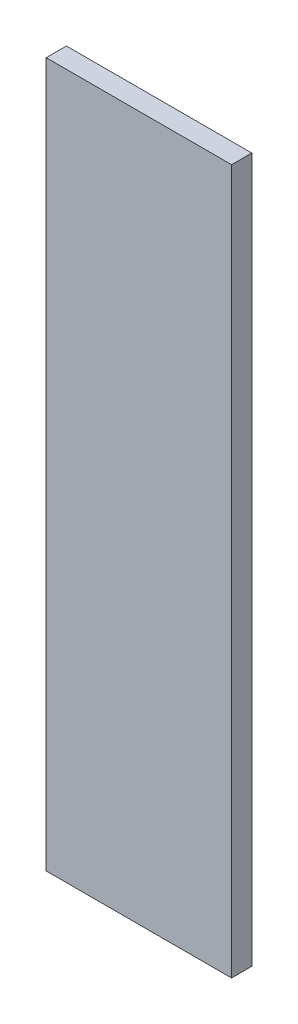
ISO-10303-21;
HEADER;
FILE_DESCRIPTION(('STEP AP214'),'2;1');
FILE_NAME('part.step','',(''),(''),'','','');
FILE_SCHEMA(('AUTOMOTIVE_DESIGN { 1 0 10303 214 1 1 1 1 }'));
ENDSEC;
DATA;
#1=APPLICATION_CONTEXT('core data for automotive mechanical design processes');
#2=APPLICATION_PROTOCOL_DEFINITION('international standard','automotive_design',2000,#1);
#3=PRODUCT_CONTEXT('',#1,'mechanical');
#4=PRODUCT('Part','Part','',(#3));
#5=PRODUCT_RELATED_PRODUCT_CATEGORY('part','',(#4));
#6=PRODUCT_DEFINITION_FORMATION('','',#4);
#7=PRODUCT_DEFINITION_CONTEXT('part definition',#1,'design');
#8=PRODUCT_DEFINITION('design','',#6,#7);
#9=PRODUCT_DEFINITION_SHAPE('','',#8);
#10=(LENGTH_UNIT() NAMED_UNIT(*) SI_UNIT(.MILLI.,.METRE.));
#11=(NAMED_UNIT(*) PLANE_ANGLE_UNIT() SI_UNIT($,.RADIAN.));
#12=(NAMED_UNIT(*) SI_UNIT($,.STERADIAN.) SOLID_ANGLE_UNIT());
#13=UNCERTAINTY_MEASURE_WITH_UNIT(LENGTH_MEASURE(1.E-05),#10,'distance_accuracy_value','');
#14=(GEOMETRIC_REPRESENTATION_CONTEXT(3) GLOBAL_UNCERTAINTY_ASSIGNED_CONTEXT((#13)) GLOBAL_UNIT_ASSIGNED_CONTEXT((#10,
#11,#12)) REPRESENTATION_CONTEXT('',''));
#15=CARTESIAN_POINT('',(0.,0.,0.));
#16=DIRECTION('',(0.,0.,1.));
#17=DIRECTION('',(1.,0.,0.));
#18=AXIS2_PLACEMENT_3D('',#15,#16,#17);
#19=CARTESIAN_POINT('',(-82.5,-313.5,18.));
#20=DIRECTION('',(1.,0.,0.));
#21=DIRECTION('',(0.,0.,-1.));
#22=AXIS2_PLACEMENT_3D('',#19,#20,#21);
#23=PLANE('',#22);
#24=DIRECTION('',(0.,-1.,0.));
#25=VECTOR('',#24,1.);
#26=CARTESIAN_POINT('',(-82.5,-313.5,0.));
#27=LINE('',#26,#25);
#28=CARTESIAN_POINT('',(-82.5,313.5,0.));
#29=VERTEX_POINT('',#28);
#30=CARTESIAN_POINT('',(-82.5,-313.5,0.));
#31=VERTEX_POINT('',#30);
#32=EDGE_CURVE('E95',#29,#31,#27,.T.);
#33=ORIENTED_EDGE('',*,*,#32,.T.);
#34=DIRECTION('',(0.,0.,-1.));
#35=VECTOR('',#34,1.);
#36=CARTESIAN_POINT('',(-82.5,-313.5,18.));
#37=LINE('',#36,#35);
#38=CARTESIAN_POINT('',(-82.5,-313.5,18.));
#39=VERTEX_POINT('',#38);
#40=EDGE_CURVE('E11',#39,#31,#37,.T.);
#41=ORIENTED_EDGE('',*,*,#40,.F.);
#42=DIRECTION('',(0.,-1.,0.));
#43=VECTOR('',#42,1.);
#44=CARTESIAN_POINT('',(-82.5,-313.5,18.));
#45=LINE('',#44,#43);
#46=CARTESIAN_POINT('',(-82.5,313.5,18.));
#47=VERTEX_POINT('',#46);
#48=EDGE_CURVE('E83',#47,#39,#45,.T.);
#49=ORIENTED_EDGE('',*,*,#48,.F.);
#50=DIRECTION('',(0.,0.,-1.));
#51=VECTOR('',#50,1.);
#52=CARTESIAN_POINT('',(-82.5,313.5,18.));
#53=LINE('',#52,#51);
#54=EDGE_CURVE('E91',#47,#29,#53,.T.);
#55=ORIENTED_EDGE('',*,*,#54,.T.);
#56=EDGE_LOOP('',(#33,#41,#49,#55));
#57=FACE_BOUND('',#56,.T.);
#58=ADVANCED_FACE('F32',(#57),#23,.F.);
#59=CARTESIAN_POINT('',(82.5,-313.5,18.));
#60=DIRECTION('',(0.,1.,0.));
#61=DIRECTION('',(0.,0.,1.));
#62=AXIS2_PLACEMENT_3D('',#59,#60,#61);
#63=PLANE('',#62);
#64=DIRECTION('',(1.,0.,0.));
#65=VECTOR('',#64,1.);
#66=CARTESIAN_POINT('',(82.5,-313.5,0.));
#67=LINE('',#66,#65);
#68=CARTESIAN_POINT('',(82.5,-313.5,0.));
#69=VERTEX_POINT('',#68);
#70=EDGE_CURVE('E87',#31,#69,#67,.T.);
#71=ORIENTED_EDGE('',*,*,#70,.T.);
#72=DIRECTION('',(0.,0.,-1.));
#73=VECTOR('',#72,1.);
#74=CARTESIAN_POINT('',(82.5,-313.5,18.));
#75=LINE('',#74,#73);
#76=CARTESIAN_POINT('',(82.5,-313.5,18.));
#77=VERTEX_POINT('',#76);
#78=EDGE_CURVE('E40',#77,#69,#75,.T.);
#79=ORIENTED_EDGE('',*,*,#78,.F.);
#80=DIRECTION('',(1.,0.,0.));
#81=VECTOR('',#80,1.);
#82=CARTESIAN_POINT('',(82.5,-313.5,18.));
#83=LINE('',#82,#81);
#84=EDGE_CURVE('E78',#39,#77,#83,.T.);
#85=ORIENTED_EDGE('',*,*,#84,.F.);
#86=ORIENTED_EDGE('',*,*,#40,.T.);
#87=EDGE_LOOP('',(#71,#79,#85,#86));
#88=FACE_BOUND('',#87,.T.);
#89=ADVANCED_FACE('F86',(#88),#63,.F.);
#90=CARTESIAN_POINT('',(82.5,-313.5,18.));
#91=DIRECTION('',(-1.,0.,0.));
#92=DIRECTION('',(0.,0.,1.));
#93=AXIS2_PLACEMENT_3D('',#90,#91,#92);
#94=PLANE('',#93);
#95=DIRECTION('',(0.,1.,0.));
#96=VECTOR('',#95,1.);
#97=CARTESIAN_POINT('',(82.5,-313.5,0.));
#98=LINE('',#97,#96);
#99=CARTESIAN_POINT('',(82.5,313.5,0.));
#100=VERTEX_POINT('',#99);
#101=EDGE_CURVE('E65',#69,#100,#98,.T.);
#102=ORIENTED_EDGE('',*,*,#101,.T.);
#103=DIRECTION('',(0.,0.,-1.));
#104=VECTOR('',#103,1.);
#105=CARTESIAN_POINT('',(82.5,313.5,18.));
#106=LINE('',#105,#104);
#107=CARTESIAN_POINT('',(82.5,313.5,18.));
#108=VERTEX_POINT('',#107);
#109=EDGE_CURVE('E88',#108,#100,#106,.T.);
#110=ORIENTED_EDGE('',*,*,#109,.F.);
#111=DIRECTION('',(0.,1.,0.));
#112=VECTOR('',#111,1.);
#113=CARTESIAN_POINT('',(82.5,-313.5,18.));
#114=LINE('',#113,#112);
#115=EDGE_CURVE('E81',#77,#108,#114,.T.);
#116=ORIENTED_EDGE('',*,*,#115,.F.);
#117=ORIENTED_EDGE('',*,*,#78,.T.);
#118=EDGE_LOOP('',(#102,#110,#116,#117));
#119=FACE_BOUND('',#118,.T.);
#120=ADVANCED_FACE('F89',(#119),#94,.F.);
#121=CARTESIAN_POINT('',(82.5,313.5,18.));
#122=DIRECTION('',(0.,-1.,0.));
#123=DIRECTION('',(0.,0.,-1.));
#124=AXIS2_PLACEMENT_3D('',#121,#122,#123);
#125=PLANE('',#124);
#126=DIRECTION('',(-1.,0.,0.));
#127=VECTOR('',#126,1.);
#128=CARTESIAN_POINT('',(82.5,313.5,0.));
#129=LINE('',#128,#127);
#130=EDGE_CURVE('E71',#100,#29,#129,.T.);
#131=ORIENTED_EDGE('',*,*,#130,.T.);
#132=ORIENTED_EDGE('',*,*,#54,.F.);
#133=DIRECTION('',(-1.,0.,0.));
#134=VECTOR('',#133,1.);
#135=CARTESIAN_POINT('',(82.5,313.5,18.));
#136=LINE('',#135,#134);
#137=EDGE_CURVE('E48',#108,#47,#136,.T.);
#138=ORIENTED_EDGE('',*,*,#137,.F.);
#139=ORIENTED_EDGE('',*,*,#109,.T.);
#140=EDGE_LOOP('',(#131,#132,#138,#139));
#141=FACE_BOUND('',#140,.T.);
#142=ADVANCED_FACE('F102',(#141),#125,.F.);
#143=CARTESIAN_POINT('',(0.,0.,18.));
#144=DIRECTION('',(0.,0.,1.));
#145=DIRECTION('',(1.,0.,0.));
#146=AXIS2_PLACEMENT_3D('',#143,#144,#145);
#147=PLANE('',#146);
#148=ORIENTED_EDGE('',*,*,#48,.T.);
#149=ORIENTED_EDGE('',*,*,#84,.T.);
#150=ORIENTED_EDGE('',*,*,#115,.T.);
#151=ORIENTED_EDGE('',*,*,#137,.T.);
#152=EDGE_LOOP('',(#148,#149,#150,#151));
#153=FACE_BOUND('',#152,.T.);
#154=ADVANCED_FACE('F79',(#153),#147,.T.);
#155=CARTESIAN_POINT('',(0.,0.,0.));
#156=DIRECTION('',(0.,0.,1.));
#157=DIRECTION('',(1.,0.,0.));
#158=AXIS2_PLACEMENT_3D('',#155,#156,#157);
#159=PLANE('',#158);
#160=ORIENTED_EDGE('',*,*,#32,.F.);
#161=ORIENTED_EDGE('',*,*,#130,.F.);
#162=ORIENTED_EDGE('',*,*,#101,.F.);
#163=ORIENTED_EDGE('',*,*,#70,.F.);
#164=EDGE_LOOP('',(#160,#161,#162,#163));
#165=FACE_BOUND('',#164,.T.);
#166=ADVANCED_FACE('F105',(#165),#159,.F.);
#167=CLOSED_SHELL('',(#58,#89,#120,#142,#154,#166));
#168=MANIFOLD_SOLID_BREP('B2',#167);
#169=ADVANCED_BREP_SHAPE_REPRESENTATION('',(#18,#168),#14);
#170=SHAPE_DEFINITION_REPRESENTATION(#9,#169);
ENDSEC;
END-ISO-10303-21;
